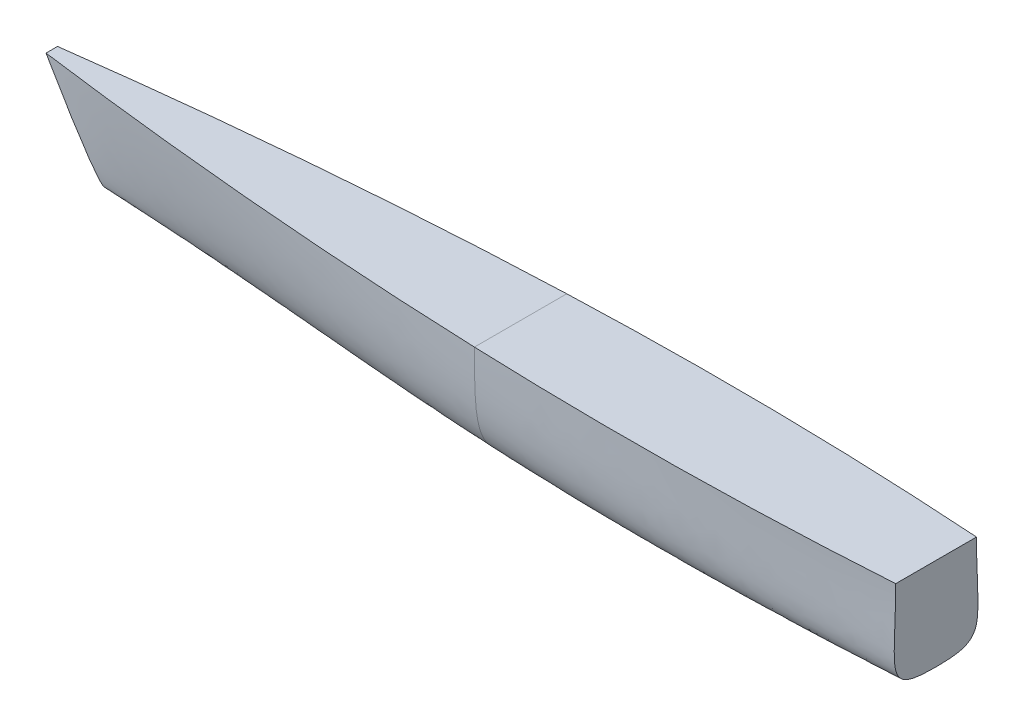
ISO-10303-21;
HEADER;
FILE_DESCRIPTION(('STEP AP214'),'2;1');
FILE_NAME('part.step','',(''),(''),'','','');
FILE_SCHEMA(('AUTOMOTIVE_DESIGN { 1 0 10303 214 1 1 1 1 }'));
ENDSEC;
DATA;
#1=APPLICATION_CONTEXT('core data for automotive mechanical design processes');
#2=APPLICATION_PROTOCOL_DEFINITION('international standard','automotive_design',2000,#1);
#3=PRODUCT_CONTEXT('',#1,'mechanical');
#4=PRODUCT('Part','Part','',(#3));
#5=PRODUCT_RELATED_PRODUCT_CATEGORY('part','',(#4));
#6=PRODUCT_DEFINITION_FORMATION('','',#4);
#7=PRODUCT_DEFINITION_CONTEXT('part definition',#1,'design');
#8=PRODUCT_DEFINITION('design','',#6,#7);
#9=PRODUCT_DEFINITION_SHAPE('','',#8);
#10=(LENGTH_UNIT() NAMED_UNIT(*) SI_UNIT(.MILLI.,.METRE.));
#11=(NAMED_UNIT(*) PLANE_ANGLE_UNIT() SI_UNIT($,.RADIAN.));
#12=(NAMED_UNIT(*) SI_UNIT($,.STERADIAN.) SOLID_ANGLE_UNIT());
#13=UNCERTAINTY_MEASURE_WITH_UNIT(LENGTH_MEASURE(1.E-05),#10,'distance_accuracy_value','');
#14=(GEOMETRIC_REPRESENTATION_CONTEXT(3) GLOBAL_UNCERTAINTY_ASSIGNED_CONTEXT((#13)) GLOBAL_UNIT_ASSIGNED_CONTEXT((#10,
#11,#12)) REPRESENTATION_CONTEXT('',''));
#15=CARTESIAN_POINT('',(0.,0.,0.));
#16=DIRECTION('',(0.,0.,1.));
#17=DIRECTION('',(1.,0.,0.));
#18=AXIS2_PLACEMENT_3D('',#15,#16,#17);
#19=CARTESIAN_POINT('',(457.2,0.,0.));
#20=CARTESIAN_POINT('',(304.8,-8.4666666666666,0.));
#21=CARTESIAN_POINT('',(-24.1558528702352,-16.9466068796095,0.));
#22=CARTESIAN_POINT('',(-304.8,-8.4666666666666,0.));
#23=CARTESIAN_POINT('',(-457.2,0.,0.));
#24=CARTESIAN_POINT('',(457.2,0.,59.2666666666667));
#25=CARTESIAN_POINT('',(304.694653848716,-5.6444444444444,62.6627208631764));
#26=CARTESIAN_POINT('',(-27.0609494606047,-19.7776781326826,62.3667373112781));
#27=CARTESIAN_POINT('',(-298.387703112432,-5.6444444444444,11.8627208631764));
#28=CARTESIAN_POINT('',(-457.2,0.,4.23333333333333));
#29=CARTESIAN_POINT('',(457.2,16.9333333333334,44.45));
#30=CARTESIAN_POINT('',(304.589307697432,14.1111111111112,51.2421083930194));
#31=CARTESIAN_POINT('',(-18.5135242684559,41.6700336822248,64.0453866142405));
#32=CARTESIAN_POINT('',(-316.767526907864,40.1189904281121,21.6087750596861));
#33=CARTESIAN_POINT('',(-481.992120683,42.9412126503344,6.35));
#34=CARTESIAN_POINT('',(457.2,101.6,44.45));
#35=CARTESIAN_POINT('',(304.483961546148,101.6,54.6381625895292));
#36=CARTESIAN_POINT('',(-5.77418516651111,101.6,58.6831296847267));
#37=CARTESIAN_POINT('',(-344.221896686963,101.6,29.2381625895292));
#38=CARTESIAN_POINT('',(-515.858787349667,101.6,6.35));
#39=B_SPLINE_SURFACE_WITH_KNOTS('',3,3,((#19,#20,#21,#22,#23),(#24,#25,#26,#27,#28),(#29,#30,
#31,#32,#33),(#34,#35,#36,#37,#38)),.UNSPECIFIED.,.F.,.F.,.F.,(4,4),(4,1,4),(0.,1.),(0.,
0.48021814139568,1.),.UNSPECIFIED.);
#40=CARTESIAN_POINT('',(457.2,0.,0.));
#41=CARTESIAN_POINT('',(304.8,-8.46666666666659,0.));
#42=CARTESIAN_POINT('',(-24.1558528702352,-16.9466068796095,0.));
#43=CARTESIAN_POINT('',(-304.8,-8.46666666666659,0.));
#44=CARTESIAN_POINT('',(-457.2,0.,0.));
#45=B_SPLINE_CURVE_WITH_KNOTS('',3,(#40,#41,#42,#43,#44),.UNSPECIFIED.,.F.,.F.,(4,1,4),(0.,
0.48021814139568,1.),.UNSPECIFIED.);
#46=CARTESIAN_POINT('',(0.,-12.6999999999999,0.));
#47=VERTEX_POINT('',#46);
#48=CARTESIAN_POINT('',(-457.2,0.,0.));
#49=VERTEX_POINT('',#48);
#50=EDGE_CURVE('E253',#47,#49,#45,.T.);
#51=CARTESIAN_POINT('',(-4.47736069341578E-09,-12.7000000000048,0.));
#52=CARTESIAN_POINT('',(-4.45366732851943E-09,-12.6999707094019,0.781487751641772));
#53=CARTESIAN_POINT('',(-4.42971820009839E-09,-12.6889781682521,1.5630419349123));
#54=CARTESIAN_POINT('',(-4.38192011345438E-09,-12.6437010870272,3.10169913771779));
#55=CARTESIAN_POINT('',(-4.3580902153228E-09,-12.6101342953921,3.85882366023383));
#56=CARTESIAN_POINT('',(-4.31043945637957E-09,-12.5199320026486,5.34902751975938));
#57=CARTESIAN_POINT('',(-4.28663958618666E-09,-12.4640154972523,6.08214958026038));
#58=CARTESIAN_POINT('',(-4.23918911087635E-09,-12.3292978902542,7.52470274285807));
#59=CARTESIAN_POINT('',(-4.21555446043169E-09,-12.2512131273073,8.2342002157884));
#60=CARTESIAN_POINT('',(-4.16826270267955E-09,-12.0723599111245,9.62987044012015));
#61=CARTESIAN_POINT('',(-4.14462530548699E-09,-11.9722988449897,10.3161332422138));
#62=CARTESIAN_POINT('',(-4.09752950081662E-09,-11.7496973949316,11.6656967473971));
#63=CARTESIAN_POINT('',(-4.07408396605494E-09,-11.6278488428377,12.3291109860748));
#64=CARTESIAN_POINT('',(-4.02712035639675E-09,-11.3618845844641,13.6333412633285));
#65=CARTESIAN_POINT('',(-4.00362036377617E-09,-11.218437850424,14.2742931580272));
#66=CARTESIAN_POINT('',(-3.95680463212218E-09,-10.9094968294993,15.5339637655974));
#67=CARTESIAN_POINT('',(-3.93349889224186E-09,-10.744640963376,16.1528385225982));
#68=CARTESIAN_POINT('',(-3.88686751606332E-09,-10.3931093121053,17.3687223145348));
#69=CARTESIAN_POINT('',(-3.8635550752632E-09,-10.2070335469576,17.9659043364015));
#70=CARTESIAN_POINT('',(-3.81699681902432E-09,-9.81329776601531,19.1387736399576));
#71=CARTESIAN_POINT('',(-3.79376047029151E-09,-9.60619170353381,19.7146464528796));
#72=CARTESIAN_POINT('',(-3.74734862029848E-09,-9.170638743577,20.8452730457951));
#73=CARTESIAN_POINT('',(-3.72418093818784E-09,-8.94269263807592,21.400219380165));
#74=CARTESIAN_POINT('',(-3.67784564586512E-09,-8.46571002893252,22.4893745727515));
#75=CARTESIAN_POINT('',(-3.65468520317717E-09,-8.21711505234996,23.0237764990578));
#76=CARTESIAN_POINT('',(-3.60848595195766E-09,-7.69909099889839,24.0722312469046));
#77=CARTESIAN_POINT('',(-3.5854507165306E-09,-7.43003948152166,24.5864703962378));
#78=CARTESIAN_POINT('',(-3.53937030355996E-09,-6.87136292875235,25.5949954602892));
#79=CARTESIAN_POINT('',(-3.51632909795275E-09,-6.58204853747093,26.0894533119272));
#80=CARTESIAN_POINT('',(-3.4703152038318E-09,-5.98310918714257,27.0588194509133));
#81=CARTESIAN_POINT('',(-3.44734429899788E-09,-5.67372701426701,27.5338776660173));
#82=CARTESIAN_POINT('',(-3.40141615486548E-09,-5.0349152857695,28.4648558464261));
#83=CARTESIAN_POINT('',(-3.37846021910957E-09,-4.70566182886777,28.9208966140225));
#84=CARTESIAN_POINT('',(-3.33260349131233E-09,-4.02736876232375,29.8142582167664));
#85=CARTESIAN_POINT('',(-3.30970303997775E-09,-3.6784417905124,30.2516645733004));
#86=CARTESIAN_POINT('',(-3.26392667012989E-09,-2.96105889858107,31.1081815755418));
#87=CARTESIAN_POINT('',(-3.24105084758921E-09,-2.59265721718293,31.5273376606002));
#88=CARTESIAN_POINT('',(-3.19532383563999E-09,-1.83657629941983,32.347782773729));
#89=CARTESIAN_POINT('',(-3.1724726435475E-09,-1.44889943992592,32.7490739932511));
#90=CARTESIAN_POINT('',(-3.12679273175931E-09,-0.654512378917812,33.5342207439993));
#91=CARTESIAN_POINT('',(-3.10396418611828E-09,-0.247760251175753,33.9180338262512));
#92=CARTESIAN_POINT('',(-3.05837700848049E-09,0.584541188637023,34.6686565761279));
#93=CARTESIAN_POINT('',(-3.03561918638764E-09,1.01016864260761,35.0353795219674));
#94=CARTESIAN_POINT('',(-2.99002738659927E-09,1.87999299346549,35.7522534280396));
#95=CARTESIAN_POINT('',(-2.96719393657309E-09,2.32429610799612,36.1022753707059));
#96=CARTESIAN_POINT('',(-2.9216009365089E-09,3.23125234239316,36.786176299614));
#97=CARTESIAN_POINT('',(-2.89884377989147E-09,3.69403197678958,37.1198873018264));
#98=CARTESIAN_POINT('',(-2.85332036073557E-09,4.63772959919391,37.7715917059864));
#99=CARTESIAN_POINT('',(-2.83055652736659E-09,5.11878730134776,38.0893825161859));
#100=CARTESIAN_POINT('',(-2.78504286890497E-09,6.09883641928646,38.7096673099536));
#101=CARTESIAN_POINT('',(-2.76229655939743E-09,6.59797454833304,39.0119291360415));
#102=CARTESIAN_POINT('',(-2.71681655609945E-09,7.61398580238174,39.6015715043192));
#103=CARTESIAN_POINT('',(-2.69408718760793E-09,8.13100744610802,39.8886957138591));
#104=CARTESIAN_POINT('',(-2.64857754172488E-09,9.18259227931243,40.4484731777496));
#105=CARTESIAN_POINT('',(-2.62580143538289E-09,9.71730163586938,40.7208513741957));
#106=CARTESIAN_POINT('',(-2.58030868260116E-09,10.8040711118557,41.251540930432));
#107=CARTESIAN_POINT('',(-2.55759860238851E-09,11.3562718509201,41.5095637587779));
#108=CARTESIAN_POINT('',(-2.51207750930681E-09,12.4778408976706,42.0119446409976));
#109=CARTESIAN_POINT('',(-2.48927105294809E-09,13.047342068145,42.2560056446732));
#110=CARTESIAN_POINT('',(-2.44375872687278E-09,14.203312921084,42.73084834855));
#111=CARTESIAN_POINT('',(-2.42106136439048E-09,14.7899058910274,42.9613287054393));
#112=CARTESIAN_POINT('',(-2.35221451287566E-09,16.5909650041421,43.6395235377354));
#113=CARTESIAN_POINT('',(-2.30655657830168E-09,17.8156729065473,44.0602109546952));
#114=CARTESIAN_POINT('',(-2.21526940078216E-09,20.3301926861742,44.8542729737344));
#115=CARTESIAN_POINT('',(-2.16970426593822E-09,21.620732712122,45.2253086462873));
#116=CARTESIAN_POINT('',(-2.07833635816551E-09,24.2656666833734,45.9231115357718));
#117=CARTESIAN_POINT('',(-2.03258926863268E-09,25.6206349326412,46.2476851700081));
#118=CARTESIAN_POINT('',(-1.94091122802775E-09,28.3930082657146,46.8554982033305));
#119=CARTESIAN_POINT('',(-1.89503776327385E-09,29.8108487118198,47.1367301403007));
#120=CARTESIAN_POINT('',(-1.8031068105125E-09,32.707567119788,47.6607732784165));
#121=CARTESIAN_POINT('',(-1.75710495937111E-09,34.186767289243,47.9017844629283));
#122=CARTESIAN_POINT('',(-1.66493108656309E-09,37.2047678238614,48.3482816640007));
#123=CARTESIAN_POINT('',(-1.61881232092425E-09,38.7438002745625,48.5521804027371));
#124=CARTESIAN_POINT('',(-1.52627915434583E-09,41.8800068374668,48.9273432886412));
#125=CARTESIAN_POINT('',(-1.47991011428412E-09,43.4773438521192,49.0972280818237));
#126=CARTESIAN_POINT('',(-1.38694311716917E-09,46.7286805702724,49.4072770566732));
#127=CARTESIAN_POINT('',(-1.34038920936828E-09,48.3827914468087,49.5462595166903));
#128=CARTESIAN_POINT('',(-1.24701070833235E-09,51.7461740770097,49.7973630062423));
#129=CARTESIAN_POINT('',(-1.20022501944852E-09,53.4555191318386,49.9084835375982));
#130=CARTESIAN_POINT('',(-1.05735405333697E-09,58.7411843474163,50.2106641212133));
#131=CARTESIAN_POINT('',(-9.63162646276416E-10,62.3200696784898,50.3566993833725));
#132=CARTESIAN_POINT('',(-8.22758162324925E-10,67.7654104503835,50.5216473998408));
#133=CARTESIAN_POINT('',(-7.7516905878392E-10,69.6312114045692,50.5679471037314));
#134=CARTESIAN_POINT('',(-6.7969903275123E-10,73.4119103561285,50.6454793729367));
#135=CARTESIAN_POINT('',(-6.3184296751189E-10,75.3268175596709,50.6762867032826));
#136=CARTESIAN_POINT('',(-5.35763610913864E-10,79.2041484885118,50.7258817368804));
#137=CARTESIAN_POINT('',(-4.87560521046109E-10,81.1665758257082,50.7443532487314));
#138=CARTESIAN_POINT('',(-3.90864017270271E-10,85.137414800624,50.7722535915417));
#139=CARTESIAN_POINT('',(-3.42390204111398E-10,87.1458279184803,50.7814607082577));
#140=CARTESIAN_POINT('',(-2.45047892762379E-10,91.2070889082284,50.793870336641));
#141=CARTESIAN_POINT('',(-1.96194377295594E-10,93.2599370936573,50.7969355390775));
#142=CARTESIAN_POINT('',(-9.81199514417062E-11,97.4085249587485,50.7999955091068));
#143=CARTESIAN_POINT('',(-4.89126889609797E-11,99.5042647053791,50.7999247910011));
#144=CARTESIAN_POINT('',(0.,101.6,50.8));
#145=B_SPLINE_CURVE_WITH_KNOTS('',3,(#51,#52,#53,#54,#55,#56,#57,#58,#59,#60,#61,#62,#63,#64,
#65,#66,#67,#68,#69,#70,#71,#72,#73,#74,#75,#76,#77,#78,#79,#80,#81,#82,#83,#84,#85,#86,#87,#88,
#89,#90,#91,#92,#93,#94,#95,#96,#97,#98,#99,#100,#101,#102,#103,#104,#105,#106,#107,#108,#109,
#110,#111,#112,#113,#114,#115,#116,#117,#118,#119,#120,#121,#122,#123,#124,#125,#126,#127,#128,
#129,#130,#131,#132,#133,#134,#135,#136,#137,#138,#139,#140,#141,#142,#143,#144),.UNSPECIFIED.,
.F.,.F.,(4,2,2,2,2,2,2,2,2,2,2,2,2,2,2,2,2,2,2,2,2,2,2,2,2,2,2,2,2,2,2,2,2,2,2,2,2,2,2,2,2,2,2,
2,2,2,4),(0.,2.34448344306046,4.61774226111642,6.82310024341743,8.96402535855335,
11.0441331812292,13.0671882793458,15.0371030237134,16.9579332678533,18.8338703702723,
20.6692291084447,22.4684311716548,24.2359841218744,25.976455971705,27.6944458284447,
29.3945513644529,31.0813341586681,32.7592841724686,34.4327847407006,36.1060794546907,
37.7832421862112,39.4681512670997,41.164468531767,42.87562359078,44.6048033744678,
46.3549466998827,48.1287433942653,49.9286373621692,51.7568329090987,53.61530362153,
55.5058031370405,59.3885196148072,63.4155115389168,67.5941712327691,71.9295940697895,
76.4249473575493,81.0817950020447,85.9003767053856,90.8798446583309,96.0184625913589,
106.762495300085,112.361605648281,118.106994580152,123.994511562909,130.019797185493,
136.178345565122,142.465558891021),.UNSPECIFIED.);
#146=CARTESIAN_POINT('',(9.40191802610385E-11,101.6,50.8000000000035));
#147=VERTEX_POINT('',#146);
#148=EDGE_CURVE('E12',#47,#147,#145,.T.);
#149=CARTESIAN_POINT('',(457.2,101.6,44.45));
#150=CARTESIAN_POINT('',(304.483961546148,101.6,54.6381625895292));
#151=CARTESIAN_POINT('',(-5.77418516651111,101.6,58.6831296847267));
#152=CARTESIAN_POINT('',(-344.221896686963,101.6,29.2381625895292));
#153=CARTESIAN_POINT('',(-515.858787349667,101.6,6.35));
#154=B_SPLINE_CURVE_WITH_KNOTS('',3,(#149,#150,#151,#152,#153),.UNSPECIFIED.,.F.,.F.,(4,1,4),
(0.,0.48021814139568,1.),.UNSPECIFIED.);
#155=CARTESIAN_POINT('',(-515.858787349667,101.6,6.35));
#156=VERTEX_POINT('',#155);
#157=EDGE_CURVE('E213',#156,#147,#154,.F.);
#158=CARTESIAN_POINT('',(-515.858787349667,101.6,6.35));
#159=CARTESIAN_POINT('',(-481.992120683,42.9412126503344,6.35));
#160=CARTESIAN_POINT('',(-457.2,0.,4.23333333333333));
#161=CARTESIAN_POINT('',(-457.2,0.,0.));
#162=B_SPLINE_CURVE_WITH_KNOTS('',3,(#158,#159,#160,#161),.UNSPECIFIED.,.F.,.F.,(4,4),(0.,1.),.UNSPECIFIED.);
#163=EDGE_CURVE('E127',#156,#49,#162,.T.);
#164=ORIENTED_EDGE('',*,*,#50,.F.);
#165=ORIENTED_EDGE('',*,*,#148,.T.);
#166=ORIENTED_EDGE('',*,*,#157,.F.);
#167=ORIENTED_EDGE('',*,*,#163,.T.);
#168=EDGE_LOOP('',(#164,#165,#166,#167));
#169=FACE_BOUND('',#168,.T.);
#170=ADVANCED_FACE('F54',(#169),#39,.T.);
#171=CARTESIAN_POINT('',(457.2,101.6,44.45));
#172=DIRECTION('',(0.,1.,0.));
#173=DIRECTION('',(0.,0.,-1.));
#174=AXIS2_PLACEMENT_3D('',#171,#172,#173);
#175=PLANE('',#174);
#176=ORIENTED_EDGE('',*,*,#157,.T.);
#177=DIRECTION('',(0.,0.,-1.));
#178=VECTOR('',#177,1.);
#179=CARTESIAN_POINT('',(0.,101.6,44.45));
#180=LINE('',#179,#178);
#181=CARTESIAN_POINT('',(9.40191802610385E-11,101.6,-50.8000000000035));
#182=VERTEX_POINT('',#181);
#183=EDGE_CURVE('E65',#147,#182,#180,.T.);
#184=ORIENTED_EDGE('',*,*,#183,.T.);
#185=CARTESIAN_POINT('',(457.2,101.6,-44.45));
#186=CARTESIAN_POINT('',(304.483961546148,101.6,-54.6381625895292));
#187=CARTESIAN_POINT('',(-5.77418516651111,101.6,-58.6831296847267));
#188=CARTESIAN_POINT('',(-344.221896686963,101.6,-29.2381625895292));
#189=CARTESIAN_POINT('',(-515.858787349667,101.6,-6.35));
#190=B_SPLINE_CURVE_WITH_KNOTS('',3,(#185,#186,#187,#188,#189),.UNSPECIFIED.,.F.,.F.,(4,1,4),
(0.,0.48021814139568,1.),.UNSPECIFIED.);
#191=CARTESIAN_POINT('',(-515.858787349667,101.6,-6.35));
#192=VERTEX_POINT('',#191);
#193=EDGE_CURVE('E115',#192,#182,#190,.F.);
#194=ORIENTED_EDGE('',*,*,#193,.F.);
#195=DIRECTION('',(0.,0.,-1.));
#196=VECTOR('',#195,1.);
#197=CARTESIAN_POINT('',(-515.858787349667,101.6,-6.35));
#198=LINE('',#197,#196);
#199=CARTESIAN_POINT('',(-515.858787349667,101.6,0.));
#200=VERTEX_POINT('',#199);
#201=EDGE_CURVE('E191',#200,#192,#198,.T.);
#202=ORIENTED_EDGE('',*,*,#201,.F.);
#203=DIRECTION('',(0.,0.,1.));
#204=VECTOR('',#203,1.);
#205=CARTESIAN_POINT('',(-515.858787349667,101.6,6.35));
#206=LINE('',#205,#204);
#207=EDGE_CURVE('E187',#200,#156,#206,.T.);
#208=ORIENTED_EDGE('',*,*,#207,.T.);
#209=EDGE_LOOP('',(#176,#184,#194,#202,#208));
#210=FACE_BOUND('',#209,.T.);
#211=ADVANCED_FACE('F333',(#210),#175,.T.);
#212=CARTESIAN_POINT('',(457.2,0.,0.));
#213=CARTESIAN_POINT('',(304.8,-8.4666666666666,0.));
#214=CARTESIAN_POINT('',(-24.1558528702352,-16.9466068796095,0.));
#215=CARTESIAN_POINT('',(-304.8,-8.4666666666666,0.));
#216=CARTESIAN_POINT('',(-457.2,0.,0.));
#217=CARTESIAN_POINT('',(457.2,0.,-59.2666666666667));
#218=CARTESIAN_POINT('',(304.694653848716,-5.6444444444444,-62.6627208631764));
#219=CARTESIAN_POINT('',(-27.0609494606047,-19.7776781326826,-62.3667373112781));
#220=CARTESIAN_POINT('',(-298.387703112432,-5.6444444444444,-11.8627208631764));
#221=CARTESIAN_POINT('',(-457.2,0.,-4.23333333333333));
#222=CARTESIAN_POINT('',(457.2,16.9333333333334,-44.45));
#223=CARTESIAN_POINT('',(304.589307697432,14.1111111111112,-51.2421083930194));
#224=CARTESIAN_POINT('',(-18.5135242684559,41.6700336822248,-64.0453866142405));
#225=CARTESIAN_POINT('',(-316.767526907864,40.1189904281121,-21.6087750596861));
#226=CARTESIAN_POINT('',(-481.992120683,42.9412126503344,-6.35));
#227=CARTESIAN_POINT('',(457.2,101.6,-44.45));
#228=CARTESIAN_POINT('',(304.483961546148,101.6,-54.6381625895292));
#229=CARTESIAN_POINT('',(-5.77418516651111,101.6,-58.6831296847267));
#230=CARTESIAN_POINT('',(-344.221896686963,101.6,-29.2381625895292));
#231=CARTESIAN_POINT('',(-515.858787349667,101.6,-6.35));
#232=B_SPLINE_SURFACE_WITH_KNOTS('',3,3,((#212,#213,#214,#215,#216),(#217,#218,#219,#220,#221),
(#222,#223,#224,#225,#226),(#227,#228,#229,#230,#231)),.UNSPECIFIED.,.F.,.F.,.F.,(4,4),(4,1,4),
(0.,1.),(0.,0.48021814139568,1.),.UNSPECIFIED.);
#233=CARTESIAN_POINT('',(9.40219175513375E-11,101.6,-50.8000000000035));
#234=CARTESIAN_POINT('',(9.03848008340078E-11,33.8666666666628,-50.800000000004));
#235=CARTESIAN_POINT('',(8.79168231380156E-11,-12.6999999999998,-50.8000000000073));
#236=CARTESIAN_POINT('',(8.88058790979759E-11,-12.6999999999998,0.));
#237=B_SPLINE_CURVE_WITH_KNOTS('',3,(#233,#234,#235,#236),.UNSPECIFIED.,.F.,.F.,(4,4),(0.,1.),.UNSPECIFIED.);
#238=EDGE_CURVE('E112',#182,#47,#237,.T.);
#239=CARTESIAN_POINT('',(-515.858787349667,101.6,-6.35));
#240=CARTESIAN_POINT('',(-481.992120683,42.9412126503344,-6.35));
#241=CARTESIAN_POINT('',(-457.2,0.,-4.23333333333333));
#242=CARTESIAN_POINT('',(-457.2,0.,0.));
#243=B_SPLINE_CURVE_WITH_KNOTS('',3,(#239,#240,#241,#242),.UNSPECIFIED.,.F.,.F.,(4,4),(0.,1.),.UNSPECIFIED.);
#244=EDGE_CURVE('E214',#192,#49,#243,.T.);
#245=ORIENTED_EDGE('',*,*,#193,.T.);
#246=ORIENTED_EDGE('',*,*,#238,.T.);
#247=ORIENTED_EDGE('',*,*,#50,.T.);
#248=ORIENTED_EDGE('',*,*,#244,.F.);
#249=EDGE_LOOP('',(#245,#246,#247,#248));
#250=FACE_BOUND('',#249,.T.);
#251=ADVANCED_FACE('F251',(#250),#232,.F.);
#252=CARTESIAN_POINT('',(-473.829393674833,28.8029547438754,4.7625));
#253=DIRECTION('',(-0.866025403784437,-0.500000000000003,0.));
#254=DIRECTION('',(0.500000000000003,-0.866025403784437,0.));
#255=AXIS2_PLACEMENT_3D('',#252,#253,#254);
#256=PLANE('',#255);
#257=ORIENTED_EDGE('',*,*,#163,.F.);
#258=ORIENTED_EDGE('',*,*,#207,.F.);
#259=ORIENTED_EDGE('',*,*,#201,.T.);
#260=ORIENTED_EDGE('',*,*,#244,.T.);
#261=EDGE_LOOP('',(#257,#258,#259,#260));
#262=FACE_BOUND('',#261,.T.);
#263=ADVANCED_FACE('F157',(#262),#256,.T.);
#264=CARTESIAN_POINT('',(457.2,19.05,44.45));
#265=DIRECTION('',(1.,0.,0.));
#266=DIRECTION('',(0.,0.,-1.));
#267=AXIS2_PLACEMENT_3D('',#264,#265,#266);
#268=PLANE('',#267);
#269=CARTESIAN_POINT('',(457.2,0.,0.));
#270=CARTESIAN_POINT('',(457.2,0.,59.2666666666667));
#271=CARTESIAN_POINT('',(457.2,16.9333333333334,44.45));
#272=CARTESIAN_POINT('',(457.2,101.6,44.45));
#273=B_SPLINE_CURVE_WITH_KNOTS('',3,(#269,#270,#271,#272),.UNSPECIFIED.,.F.,.F.,(4,4),(0.,1.),.UNSPECIFIED.);
#274=CARTESIAN_POINT('',(457.2,0.,0.));
#275=VERTEX_POINT('',#274);
#276=CARTESIAN_POINT('',(457.2,101.6,44.45));
#277=VERTEX_POINT('',#276);
#278=EDGE_CURVE('E135',#275,#277,#273,.T.);
#279=ORIENTED_EDGE('',*,*,#278,.F.);
#280=CARTESIAN_POINT('',(457.2,0.,0.));
#281=CARTESIAN_POINT('',(457.2,0.,-59.2666666666667));
#282=CARTESIAN_POINT('',(457.2,16.9333333333334,-44.45));
#283=CARTESIAN_POINT('',(457.2,101.6,-44.45));
#284=B_SPLINE_CURVE_WITH_KNOTS('',3,(#280,#281,#282,#283),.UNSPECIFIED.,.F.,.F.,(4,4),(0.,1.),.UNSPECIFIED.);
#285=CARTESIAN_POINT('',(457.2,101.6,-44.45));
#286=VERTEX_POINT('',#285);
#287=EDGE_CURVE('E108',#275,#286,#284,.T.);
#288=ORIENTED_EDGE('',*,*,#287,.T.);
#289=DIRECTION('',(0.,0.,1.));
#290=VECTOR('',#289,1.);
#291=CARTESIAN_POINT('',(457.2,101.6,-44.45));
#292=LINE('',#291,#290);
#293=CARTESIAN_POINT('',(457.2,101.6,0.));
#294=VERTEX_POINT('',#293);
#295=EDGE_CURVE('E119',#286,#294,#292,.T.);
#296=ORIENTED_EDGE('',*,*,#295,.T.);
#297=DIRECTION('',(0.,0.,-1.));
#298=VECTOR('',#297,1.);
#299=CARTESIAN_POINT('',(457.2,101.6,44.45));
#300=LINE('',#299,#298);
#301=EDGE_CURVE('E123',#277,#294,#300,.T.);
#302=ORIENTED_EDGE('',*,*,#301,.F.);
#303=EDGE_LOOP('',(#279,#288,#296,#302));
#304=FACE_BOUND('',#303,.T.);
#305=ADVANCED_FACE('F133',(#304),#268,.T.);
#306=ORIENTED_EDGE('',*,*,#183,.F.);
#307=EDGE_CURVE('E190',#147,#277,#154,.F.);
#308=ORIENTED_EDGE('',*,*,#307,.T.);
#309=ORIENTED_EDGE('',*,*,#301,.T.);
#310=ORIENTED_EDGE('',*,*,#295,.F.);
#311=EDGE_CURVE('E103',#182,#286,#190,.F.);
#312=ORIENTED_EDGE('',*,*,#311,.F.);
#313=EDGE_LOOP('',(#306,#308,#309,#310,#312));
#314=FACE_BOUND('',#313,.T.);
#315=ADVANCED_FACE('F121',(#314),#175,.T.);
#316=EDGE_CURVE('E116',#275,#47,#45,.T.);
#317=ORIENTED_EDGE('',*,*,#148,.F.);
#318=ORIENTED_EDGE('',*,*,#316,.F.);
#319=ORIENTED_EDGE('',*,*,#278,.T.);
#320=ORIENTED_EDGE('',*,*,#307,.F.);
#321=EDGE_LOOP('',(#317,#318,#319,#320));
#322=FACE_BOUND('',#321,.T.);
#323=ADVANCED_FACE('F307',(#322),#39,.T.);
#324=ORIENTED_EDGE('',*,*,#238,.F.);
#325=ORIENTED_EDGE('',*,*,#311,.T.);
#326=ORIENTED_EDGE('',*,*,#287,.F.);
#327=ORIENTED_EDGE('',*,*,#316,.T.);
#328=EDGE_LOOP('',(#324,#325,#326,#327));
#329=FACE_BOUND('',#328,.T.);
#330=ADVANCED_FACE('F105',(#329),#232,.F.);
#331=CLOSED_SHELL('',(#170,#211,#251,#263,#305,#315,#323,#330));
#332=MANIFOLD_SOLID_BREP('B2',#331);
#333=ADVANCED_BREP_SHAPE_REPRESENTATION('',(#18,#332),#14);
#334=SHAPE_DEFINITION_REPRESENTATION(#9,#333);
ENDSEC;
END-ISO-10303-21;
